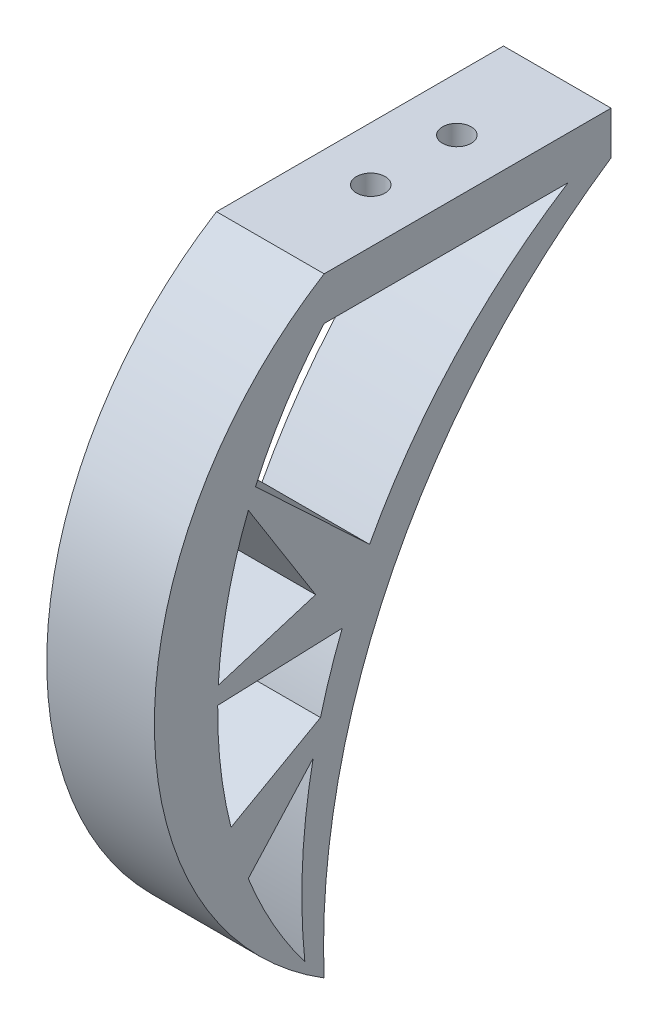
ISO-10303-21;
HEADER;
FILE_DESCRIPTION(('STEP AP214'),'2;1');
FILE_NAME('part.step','',(''),(''),'','','');
FILE_SCHEMA(('AUTOMOTIVE_DESIGN { 1 0 10303 214 1 1 1 1 }'));
ENDSEC;
DATA;
#1=APPLICATION_CONTEXT('core data for automotive mechanical design processes');
#2=APPLICATION_PROTOCOL_DEFINITION('international standard','automotive_design',2000,#1);
#3=PRODUCT_CONTEXT('',#1,'mechanical');
#4=PRODUCT('Part','Part','',(#3));
#5=PRODUCT_RELATED_PRODUCT_CATEGORY('part','',(#4));
#6=PRODUCT_DEFINITION_FORMATION('','',#4);
#7=PRODUCT_DEFINITION_CONTEXT('part definition',#1,'design');
#8=PRODUCT_DEFINITION('design','',#6,#7);
#9=PRODUCT_DEFINITION_SHAPE('','',#8);
#10=(LENGTH_UNIT() NAMED_UNIT(*) SI_UNIT(.MILLI.,.METRE.));
#11=(NAMED_UNIT(*) PLANE_ANGLE_UNIT() SI_UNIT($,.RADIAN.));
#12=(NAMED_UNIT(*) SI_UNIT($,.STERADIAN.) SOLID_ANGLE_UNIT());
#13=UNCERTAINTY_MEASURE_WITH_UNIT(LENGTH_MEASURE(1.E-05),#10,'distance_accuracy_value','');
#14=(GEOMETRIC_REPRESENTATION_CONTEXT(3) GLOBAL_UNCERTAINTY_ASSIGNED_CONTEXT((#13)) GLOBAL_UNIT_ASSIGNED_CONTEXT((#10,
#11,#12)) REPRESENTATION_CONTEXT('',''));
#15=CARTESIAN_POINT('',(0.,0.,0.));
#16=DIRECTION('',(0.,0.,1.));
#17=DIRECTION('',(1.,0.,0.));
#18=AXIS2_PLACEMENT_3D('',#15,#16,#17);
#19=CARTESIAN_POINT('',(15.,-39.5,-45.1635915312323));
#20=DIRECTION('',(-1.,0.,0.));
#21=DIRECTION('',(0.,0.,1.));
#22=AXIS2_PLACEMENT_3D('',#19,#20,#21);
#23=CYLINDRICAL_SURFACE('',#22,60.);
#24=DIRECTION('',(-1.,0.,0.));
#25=VECTOR('',#24,1.);
#26=CARTESIAN_POINT('',(15.,-17.2561392210041,10.5608255374518));
#27=LINE('',#26,#25);
#28=CARTESIAN_POINT('',(15.,-17.2561392210041,10.5608255374517));
#29=VERTEX_POINT('',#28);
#30=CARTESIAN_POINT('',(0.,-17.2561392210041,10.5608255374518));
#31=VERTEX_POINT('',#30);
#32=EDGE_CURVE('E283',#29,#31,#27,.T.);
#33=ORIENTED_EDGE('',*,*,#32,.F.);
#34=CARTESIAN_POINT('',(15.,-39.5,-45.1635915312323));
#35=DIRECTION('',(1.,0.,0.));
#36=DIRECTION('',(0.,0.,1.));
#37=AXIS2_PLACEMENT_3D('',#34,#35,#36);
#38=CIRCLE('',#37,60.);
#39=CARTESIAN_POINT('',(15.,-36.2880127135496,14.7503729317514));
#40=VERTEX_POINT('',#39);
#41=EDGE_CURVE('E221',#29,#40,#38,.T.);
#42=ORIENTED_EDGE('',*,*,#41,.T.);
#43=DIRECTION('',(-1.,0.,0.));
#44=VECTOR('',#43,1.);
#45=CARTESIAN_POINT('',(15.,-36.2880127135496,14.7503729317514));
#46=LINE('',#45,#44);
#47=CARTESIAN_POINT('',(0.,-36.2880127135496,14.7503729317514));
#48=VERTEX_POINT('',#47);
#49=EDGE_CURVE('E171',#48,#40,#46,.F.);
#50=ORIENTED_EDGE('',*,*,#49,.F.);
#51=CARTESIAN_POINT('',(0.,-39.5,-45.1635915312323));
#52=DIRECTION('',(1.,0.,0.));
#53=DIRECTION('',(0.,0.,1.));
#54=AXIS2_PLACEMENT_3D('',#51,#52,#53);
#55=CIRCLE('',#54,60.);
#56=EDGE_CURVE('E58',#31,#48,#55,.T.);
#57=ORIENTED_EDGE('',*,*,#56,.F.);
#58=EDGE_LOOP('',(#33,#42,#50,#57));
#59=FACE_BOUND('',#58,.T.);
#60=ADVANCED_FACE('F35',(#59),#23,.F.);
#61=DIRECTION('',(1.,0.,0.));
#62=VECTOR('',#61,1.);
#63=CARTESIAN_POINT('',(0.,-54.3296215570334,12.9748838914615));
#64=LINE('',#63,#62);
#65=CARTESIAN_POINT('',(0.,-54.3296215570334,12.9748838914615));
#66=VERTEX_POINT('',#65);
#67=CARTESIAN_POINT('',(15.,-54.3296215570334,12.9748838914615));
#68=VERTEX_POINT('',#67);
#69=EDGE_CURVE('E272',#66,#68,#64,.T.);
#70=ORIENTED_EDGE('',*,*,#69,.F.);
#71=CARTESIAN_POINT('',(0.,-38.6765079655165,14.8307570431888));
#72=VERTEX_POINT('',#71);
#73=EDGE_CURVE('E226',#72,#66,#55,.T.);
#74=ORIENTED_EDGE('',*,*,#73,.F.);
#75=DIRECTION('',(-1.,0.,0.));
#76=VECTOR('',#75,1.);
#77=CARTESIAN_POINT('',(15.,-38.6765079655165,14.8307570431888));
#78=LINE('',#77,#76);
#79=CARTESIAN_POINT('',(15.,-38.6765079655165,14.8307570431888));
#80=VERTEX_POINT('',#79);
#81=EDGE_CURVE('E189',#80,#72,#78,.T.);
#82=ORIENTED_EDGE('',*,*,#81,.F.);
#83=EDGE_CURVE('E222',#80,#68,#38,.T.);
#84=ORIENTED_EDGE('',*,*,#83,.T.);
#85=EDGE_LOOP('',(#70,#74,#82,#84));
#86=FACE_BOUND('',#85,.T.);
#87=ADVANCED_FACE('F334',(#86),#23,.F.);
#88=CARTESIAN_POINT('',(15.,-67.5284609681816,-76.894136653729));
#89=DIRECTION('',(-1.,0.,0.));
#90=DIRECTION('',(0.,0.,1.));
#91=AXIS2_PLACEMENT_3D('',#88,#89,#90);
#92=CYLINDRICAL_SURFACE('',#91,80.);
#93=DIRECTION('',(-1.,0.,0.));
#94=VECTOR('',#93,1.);
#95=CARTESIAN_POINT('',(15.,-47.3067647519929,0.507949895279358));
#96=LINE('',#95,#94);
#97=CARTESIAN_POINT('',(15.,-47.3067647519929,0.507949895279351));
#98=VERTEX_POINT('',#97);
#99=CARTESIAN_POINT('',(0.,-47.3067647519929,0.507949895279358));
#100=VERTEX_POINT('',#99);
#101=EDGE_CURVE('E43',#98,#100,#96,.T.);
#102=ORIENTED_EDGE('',*,*,#101,.F.);
#103=CARTESIAN_POINT('',(15.,-67.5284609681816,-76.894136653729));
#104=DIRECTION('',(-1.,0.,0.));
#105=DIRECTION('',(0.,0.,1.));
#106=AXIS2_PLACEMENT_3D('',#103,#104,#105);
#107=CIRCLE('',#106,80.);
#108=CARTESIAN_POINT('',(15.,-38.0360001224991,-2.52885743509172));
#109=VERTEX_POINT('',#108);
#110=EDGE_CURVE('E206',#98,#109,#107,.T.);
#111=ORIENTED_EDGE('',*,*,#110,.T.);
#112=DIRECTION('',(1.,0.,0.));
#113=VECTOR('',#112,1.);
#114=CARTESIAN_POINT('',(0.,-38.0360001224991,-2.52885743509172));
#115=LINE('',#114,#113);
#116=CARTESIAN_POINT('',(0.,-38.0360001224991,-2.52885743509172));
#117=VERTEX_POINT('',#116);
#118=EDGE_CURVE('E172',#117,#109,#115,.T.);
#119=ORIENTED_EDGE('',*,*,#118,.F.);
#120=CARTESIAN_POINT('',(0.,-67.5284609681816,-76.894136653729));
#121=DIRECTION('',(-1.,0.,0.));
#122=DIRECTION('',(0.,0.,1.));
#123=AXIS2_PLACEMENT_3D('',#120,#121,#122);
#124=CIRCLE('',#123,80.);
#125=EDGE_CURVE('E188',#100,#117,#124,.T.);
#126=ORIENTED_EDGE('',*,*,#125,.F.);
#127=EDGE_LOOP('',(#102,#111,#119,#126));
#128=FACE_BOUND('',#127,.T.);
#129=ADVANCED_FACE('F331',(#128),#92,.T.);
#130=DIRECTION('',(-1.,0.,0.));
#131=VECTOR('',#130,1.);
#132=CARTESIAN_POINT('',(15.,-61.71787157674,10.5711927834081));
#133=LINE('',#132,#131);
#134=CARTESIAN_POINT('',(15.,-61.71787157674,10.5711927834081));
#135=VERTEX_POINT('',#134);
#136=CARTESIAN_POINT('',(0.,-61.71787157674,10.5711927834081));
#137=VERTEX_POINT('',#136);
#138=EDGE_CURVE('E275',#135,#137,#133,.T.);
#139=ORIENTED_EDGE('',*,*,#138,.F.);
#140=CARTESIAN_POINT('',(15.,-75.6974368613785,2.68769439366752));
#141=VERTEX_POINT('',#140);
#142=EDGE_CURVE('E218',#135,#141,#38,.T.);
#143=ORIENTED_EDGE('',*,*,#142,.T.);
#144=DIRECTION('',(-1.,0.,0.));
#145=VECTOR('',#144,1.);
#146=CARTESIAN_POINT('',(15.,-75.6974368613785,2.68769439366752));
#147=LINE('',#146,#145);
#148=CARTESIAN_POINT('',(0.,-75.6974368613785,2.68769439366752));
#149=VERTEX_POINT('',#148);
#150=EDGE_CURVE('E212',#141,#149,#147,.T.);
#151=ORIENTED_EDGE('',*,*,#150,.T.);
#152=EDGE_CURVE('E224',#137,#149,#55,.T.);
#153=ORIENTED_EDGE('',*,*,#152,.F.);
#154=EDGE_LOOP('',(#139,#143,#151,#153));
#155=FACE_BOUND('',#154,.T.);
#156=ADVANCED_FACE('F328',(#155),#23,.F.);
#157=DIRECTION('',(1.,0.,0.));
#158=VECTOR('',#157,1.);
#159=CARTESIAN_POINT('',(0.,-29.8247878103833,-6.33612484493494));
#160=LINE('',#159,#158);
#161=CARTESIAN_POINT('',(0.,-29.8247878103833,-6.33612484493494));
#162=VERTEX_POINT('',#161);
#163=CARTESIAN_POINT('',(15.,-29.8247878103833,-6.33612484493494));
#164=VERTEX_POINT('',#163);
#165=EDGE_CURVE('E162',#162,#164,#160,.T.);
#166=ORIENTED_EDGE('',*,*,#165,.T.);
#167=CARTESIAN_POINT('',(15.,0.,-34.));
#168=VERTEX_POINT('',#167);
#169=EDGE_CURVE('E201',#164,#168,#107,.T.);
#170=ORIENTED_EDGE('',*,*,#169,.T.);
#171=DIRECTION('',(-1.,0.,0.));
#172=VECTOR('',#171,1.);
#173=CARTESIAN_POINT('',(15.,0.,-34.));
#174=LINE('',#173,#172);
#175=CARTESIAN_POINT('',(0.,0.,-34.));
#176=VERTEX_POINT('',#175);
#177=EDGE_CURVE('E186',#168,#176,#174,.T.);
#178=ORIENTED_EDGE('',*,*,#177,.T.);
#179=EDGE_CURVE('E177',#162,#176,#124,.T.);
#180=ORIENTED_EDGE('',*,*,#179,.F.);
#181=EDGE_LOOP('',(#166,#170,#178,#180));
#182=FACE_BOUND('',#181,.T.);
#183=ADVANCED_FACE('F184',(#182),#92,.T.);
#184=CARTESIAN_POINT('',(0.,6.,0.));
#185=DIRECTION('',(1.,0.,0.));
#186=DIRECTION('',(0.,0.,-1.));
#187=AXIS2_PLACEMENT_3D('',#184,#185,#186);
#188=PLANE('',#187);
#189=DIRECTION('',(0.,-0.846121438785916,-0.532990160159502));
#190=VECTOR('',#189,1.);
#191=CARTESIAN_POINT('',(0.,-38.0360001224991,-2.52885743509172));
#192=LINE('',#191,#190);
#193=CARTESIAN_POINT('',(0.,-32.1317338202483,1.19036736859185));
#194=VERTEX_POINT('',#193);
#195=EDGE_CURVE('E182',#31,#194,#192,.T.);
#196=ORIENTED_EDGE('',*,*,#195,.F.);
#197=ORIENTED_EDGE('',*,*,#56,.T.);
#198=DIRECTION('',(0.,-0.293053143995621,0.956096153529697));
#199=VECTOR('',#198,1.);
#200=CARTESIAN_POINT('',(0.,-39.,23.5983265064636));
#201=LINE('',#200,#199);
#202=EDGE_CURVE('E291',#194,#48,#201,.T.);
#203=ORIENTED_EDGE('',*,*,#202,.F.);
#204=EDGE_LOOP('',(#196,#197,#203));
#205=FACE_BOUND('',#204,.T.);
#206=ORIENTED_EDGE('',*,*,#125,.T.);
#207=DIRECTION('',(0.,0.0368713436477683,-0.999320020822964));
#208=VECTOR('',#207,1.);
#209=CARTESIAN_POINT('',(0.,-39.,23.5983265064636));
#210=LINE('',#209,#208);
#211=EDGE_CURVE('E288',#72,#117,#210,.T.);
#212=ORIENTED_EDGE('',*,*,#211,.F.);
#213=ORIENTED_EDGE('',*,*,#73,.T.);
#214=DIRECTION('',(0.,-0.490802992807223,0.871270579241302));
#215=VECTOR('',#214,1.);
#216=CARTESIAN_POINT('',(0.,-54.3296215570334,12.9748838914615));
#217=LINE('',#216,#215);
#218=EDGE_CURVE('E263',#100,#66,#217,.T.);
#219=ORIENTED_EDGE('',*,*,#218,.F.);
#220=EDGE_LOOP('',(#206,#212,#213,#219));
#221=FACE_BOUND('',#220,.T.);
#222=CARTESIAN_POINT('',(0.,-36.5,-26.3391343821318));
#223=DIRECTION('',(-1.,0.,0.));
#224=DIRECTION('',(0.,0.,1.));
#225=AXIS2_PLACEMENT_3D('',#222,#223,#224);
#226=CIRCLE('',#225,50.);
#227=CARTESIAN_POINT('',(0.,-79.,0.));
#228=VERTEX_POINT('',#227);
#229=CARTESIAN_POINT('',(0.,6.,0.));
#230=VERTEX_POINT('',#229);
#231=EDGE_CURVE('E211',#228,#230,#226,.T.);
#232=ORIENTED_EDGE('',*,*,#231,.T.);
#233=DIRECTION('',(0.,0.,1.));
#234=VECTOR('',#233,1.);
#235=CARTESIAN_POINT('',(0.,6.,0.));
#236=LINE('',#235,#234);
#237=CARTESIAN_POINT('',(0.,6.,-40.));
#238=VERTEX_POINT('',#237);
#239=EDGE_CURVE('E229',#238,#230,#236,.T.);
#240=ORIENTED_EDGE('',*,*,#239,.F.);
#241=DIRECTION('',(0.,-1.,0.));
#242=VECTOR('',#241,1.);
#243=CARTESIAN_POINT('',(0.,6.,-40.));
#244=LINE('',#243,#242);
#245=CARTESIAN_POINT('',(0.,0.,-40.));
#246=VERTEX_POINT('',#245);
#247=EDGE_CURVE('E240',#238,#246,#244,.T.);
#248=ORIENTED_EDGE('',*,*,#247,.T.);
#249=CARTESIAN_POINT('',(0.,-75.2077576845932,-90.5228214270715));
#250=DIRECTION('',(-1.,0.,0.));
#251=DIRECTION('',(0.,0.,1.));
#252=AXIS2_PLACEMENT_3D('',#249,#250,#251);
#253=CIRCLE('',#252,90.6022201764186);
#254=EDGE_CURVE('E197',#228,#246,#253,.T.);
#255=ORIENTED_EDGE('',*,*,#254,.F.);
#256=EDGE_LOOP('',(#232,#240,#248,#255));
#257=FACE_BOUND('',#256,.T.);
#258=CARTESIAN_POINT('',(0.,0.,0.));
#259=VERTEX_POINT('',#258);
#260=CARTESIAN_POINT('',(0.,-14.9150873128539,9.56831934501429));
#261=VERTEX_POINT('',#260);
#262=EDGE_CURVE('E180',#259,#261,#55,.T.);
#263=ORIENTED_EDGE('',*,*,#262,.T.);
#264=DIRECTION('',(0.,0.68392365017191,0.729553590036764));
#265=VECTOR('',#264,1.);
#266=CARTESIAN_POINT('',(0.,-9.26672138220689,15.5935323077611));
#267=LINE('',#266,#265);
#268=EDGE_CURVE('E165',#162,#261,#267,.T.);
#269=ORIENTED_EDGE('',*,*,#268,.F.);
#270=ORIENTED_EDGE('',*,*,#179,.T.);
#271=DIRECTION('',(0.,0.,1.));
#272=VECTOR('',#271,1.);
#273=CARTESIAN_POINT('',(0.,0.,0.));
#274=LINE('',#273,#272);
#275=EDGE_CURVE('E228',#176,#259,#274,.T.);
#276=ORIENTED_EDGE('',*,*,#275,.T.);
#277=EDGE_LOOP('',(#263,#269,#270,#276));
#278=FACE_BOUND('',#277,.T.);
#279=DIRECTION('',(0.,0.742231143873996,-0.670143961446718));
#280=VECTOR('',#279,1.);
#281=CARTESIAN_POINT('',(0.,-43.926999792177,-5.49178893556122));
#282=LINE('',#281,#280);
#283=CARTESIAN_POINT('',(0.,-51.6972542362221,1.52380066554739));
#284=VERTEX_POINT('',#283);
#285=EDGE_CURVE('E273',#137,#284,#282,.T.);
#286=ORIENTED_EDGE('',*,*,#285,.F.);
#287=ORIENTED_EDGE('',*,*,#152,.T.);
#288=EDGE_CURVE('E191',#149,#284,#124,.T.);
#289=ORIENTED_EDGE('',*,*,#288,.T.);
#290=EDGE_LOOP('',(#286,#287,#289));
#291=FACE_BOUND('',#290,.T.);
#292=ADVANCED_FACE('F37',(#205,#221,#257,#278,#291),#188,.F.);
#293=CARTESIAN_POINT('',(15.,6.,0.));
#294=DIRECTION('',(-1.,0.,0.));
#295=DIRECTION('',(0.,0.,1.));
#296=AXIS2_PLACEMENT_3D('',#293,#294,#295);
#297=PLANE('',#296);
#298=DIRECTION('',(0.,-0.846121438785916,-0.532990160159502));
#299=VECTOR('',#298,1.);
#300=CARTESIAN_POINT('',(15.,-38.0360001224991,-2.52885743509172));
#301=LINE('',#300,#299);
#302=CARTESIAN_POINT('',(15.,-32.1317338202483,1.19036736859185));
#303=VERTEX_POINT('',#302);
#304=EDGE_CURVE('E364',#29,#303,#301,.T.);
#305=ORIENTED_EDGE('',*,*,#304,.T.);
#306=DIRECTION('',(0.,-0.293053143995621,0.956096153529697));
#307=VECTOR('',#306,1.);
#308=CARTESIAN_POINT('',(15.,-39.,23.5983265064636));
#309=LINE('',#308,#307);
#310=EDGE_CURVE('E292',#303,#40,#309,.T.);
#311=ORIENTED_EDGE('',*,*,#310,.T.);
#312=ORIENTED_EDGE('',*,*,#41,.F.);
#313=EDGE_LOOP('',(#305,#311,#312));
#314=FACE_BOUND('',#313,.T.);
#315=DIRECTION('',(0.,0.,-1.));
#316=VECTOR('',#315,1.);
#317=CARTESIAN_POINT('',(15.,6.,0.));
#318=LINE('',#317,#316);
#319=CARTESIAN_POINT('',(15.,6.,0.));
#320=VERTEX_POINT('',#319);
#321=CARTESIAN_POINT('',(15.,6.,-40.));
#322=VERTEX_POINT('',#321);
#323=EDGE_CURVE('E236',#320,#322,#318,.T.);
#324=ORIENTED_EDGE('',*,*,#323,.F.);
#325=CARTESIAN_POINT('',(15.,-36.5,-26.3391343821318));
#326=DIRECTION('',(-1.,0.,0.));
#327=DIRECTION('',(0.,0.,1.));
#328=AXIS2_PLACEMENT_3D('',#325,#326,#327);
#329=CIRCLE('',#328,50.);
#330=CARTESIAN_POINT('',(15.,-79.,0.));
#331=VERTEX_POINT('',#330);
#332=EDGE_CURVE('E216',#331,#320,#329,.T.);
#333=ORIENTED_EDGE('',*,*,#332,.F.);
#334=CARTESIAN_POINT('',(15.,-75.2077576845932,-90.5228214270715));
#335=DIRECTION('',(-1.,0.,0.));
#336=DIRECTION('',(0.,0.,1.));
#337=AXIS2_PLACEMENT_3D('',#334,#335,#336);
#338=CIRCLE('',#337,90.6022201764186);
#339=CARTESIAN_POINT('',(15.,0.,-40.));
#340=VERTEX_POINT('',#339);
#341=EDGE_CURVE('E215',#331,#340,#338,.T.);
#342=ORIENTED_EDGE('',*,*,#341,.T.);
#343=DIRECTION('',(0.,-1.,0.));
#344=VECTOR('',#343,1.);
#345=CARTESIAN_POINT('',(15.,6.,-40.));
#346=LINE('',#345,#344);
#347=EDGE_CURVE('E250',#322,#340,#346,.T.);
#348=ORIENTED_EDGE('',*,*,#347,.F.);
#349=EDGE_LOOP('',(#324,#333,#342,#348));
#350=FACE_BOUND('',#349,.T.);
#351=DIRECTION('',(0.,0.68392365017191,0.729553590036764));
#352=VECTOR('',#351,1.);
#353=CARTESIAN_POINT('',(15.,-9.26672138220689,15.5935323077611));
#354=LINE('',#353,#352);
#355=CARTESIAN_POINT('',(15.,-14.9150873128539,9.56831934501429));
#356=VERTEX_POINT('',#355);
#357=EDGE_CURVE('E167',#164,#356,#354,.T.);
#358=ORIENTED_EDGE('',*,*,#357,.T.);
#359=CARTESIAN_POINT('',(15.,0.,0.));
#360=VERTEX_POINT('',#359);
#361=EDGE_CURVE('E50',#360,#356,#38,.T.);
#362=ORIENTED_EDGE('',*,*,#361,.F.);
#363=DIRECTION('',(0.,0.,-1.));
#364=VECTOR('',#363,1.);
#365=CARTESIAN_POINT('',(15.,0.,0.));
#366=LINE('',#365,#364);
#367=EDGE_CURVE('E244',#360,#168,#366,.T.);
#368=ORIENTED_EDGE('',*,*,#367,.T.);
#369=ORIENTED_EDGE('',*,*,#169,.F.);
#370=EDGE_LOOP('',(#358,#362,#368,#369));
#371=FACE_BOUND('',#370,.T.);
#372=ORIENTED_EDGE('',*,*,#142,.F.);
#373=DIRECTION('',(0.,0.742231143873996,-0.670143961446718));
#374=VECTOR('',#373,1.);
#375=CARTESIAN_POINT('',(15.,-43.926999792177,-5.49178893556122));
#376=LINE('',#375,#374);
#377=CARTESIAN_POINT('',(15.,-51.6972542362221,1.52380066554739));
#378=VERTEX_POINT('',#377);
#379=EDGE_CURVE('E280',#135,#378,#376,.T.);
#380=ORIENTED_EDGE('',*,*,#379,.T.);
#381=EDGE_CURVE('E208',#141,#378,#107,.T.);
#382=ORIENTED_EDGE('',*,*,#381,.F.);
#383=EDGE_LOOP('',(#372,#380,#382));
#384=FACE_BOUND('',#383,.T.);
#385=DIRECTION('',(0.,0.0368713436477683,-0.999320020822964));
#386=VECTOR('',#385,1.);
#387=CARTESIAN_POINT('',(15.,-39.,23.5983265064636));
#388=LINE('',#387,#386);
#389=EDGE_CURVE('E287',#80,#109,#388,.T.);
#390=ORIENTED_EDGE('',*,*,#389,.T.);
#391=ORIENTED_EDGE('',*,*,#110,.F.);
#392=DIRECTION('',(0.,-0.490802992807223,0.871270579241302));
#393=VECTOR('',#392,1.);
#394=CARTESIAN_POINT('',(15.,-54.3296215570334,12.9748838914615));
#395=LINE('',#394,#393);
#396=EDGE_CURVE('E265',#98,#68,#395,.T.);
#397=ORIENTED_EDGE('',*,*,#396,.T.);
#398=ORIENTED_EDGE('',*,*,#83,.F.);
#399=EDGE_LOOP('',(#390,#391,#397,#398));
#400=FACE_BOUND('',#399,.T.);
#401=ADVANCED_FACE('F306',(#314,#350,#371,#384,#400),#297,.F.);
#402=CARTESIAN_POINT('',(0.,6.,-40.));
#403=DIRECTION('',(0.,0.,1.));
#404=DIRECTION('',(1.,0.,0.));
#405=AXIS2_PLACEMENT_3D('',#402,#403,#404);
#406=PLANE('',#405);
#407=DIRECTION('',(-1.,0.,0.));
#408=VECTOR('',#407,1.);
#409=CARTESIAN_POINT('',(0.,0.,-40.));
#410=LINE('',#409,#408);
#411=EDGE_CURVE('E233',#340,#246,#410,.T.);
#412=ORIENTED_EDGE('',*,*,#411,.T.);
#413=ORIENTED_EDGE('',*,*,#247,.F.);
#414=DIRECTION('',(-1.,0.,0.));
#415=VECTOR('',#414,1.);
#416=CARTESIAN_POINT('',(0.,6.,-40.));
#417=LINE('',#416,#415);
#418=EDGE_CURVE('E238',#322,#238,#417,.T.);
#419=ORIENTED_EDGE('',*,*,#418,.F.);
#420=ORIENTED_EDGE('',*,*,#347,.T.);
#421=EDGE_LOOP('',(#412,#413,#419,#420));
#422=FACE_BOUND('',#421,.T.);
#423=ADVANCED_FACE('F313',(#422),#406,.F.);
#424=CARTESIAN_POINT('',(0.,6.,0.));
#425=DIRECTION('',(0.,-1.,0.));
#426=DIRECTION('',(0.,0.,-1.));
#427=AXIS2_PLACEMENT_3D('',#424,#425,#426);
#428=PLANE('',#427);
#429=CARTESIAN_POINT('',(7.50000000000001,6.,-26.));
#430=DIRECTION('',(0.,1.,0.));
#431=DIRECTION('',(0.,0.,1.));
#432=AXIS2_PLACEMENT_3D('',#429,#430,#431);
#433=CIRCLE('',#432,2.);
#434=CARTESIAN_POINT('',(7.50000000000001,6.,-24.));
#435=VERTEX_POINT('',#434);
#436=EDGE_CURVE('E405',#435,#435,#433,.T.);
#437=ORIENTED_EDGE('',*,*,#436,.F.);
#438=EDGE_LOOP('',(#437));
#439=FACE_BOUND('',#438,.T.);
#440=CARTESIAN_POINT('',(7.50000000000001,6.,-14.));
#441=DIRECTION('',(0.,1.,0.));
#442=DIRECTION('',(0.,0.,1.));
#443=AXIS2_PLACEMENT_3D('',#440,#441,#442);
#444=CIRCLE('',#443,2.);
#445=CARTESIAN_POINT('',(7.50000000000001,6.,-12.));
#446=VERTEX_POINT('',#445);
#447=EDGE_CURVE('E409',#446,#446,#444,.T.);
#448=ORIENTED_EDGE('',*,*,#447,.F.);
#449=EDGE_LOOP('',(#448));
#450=FACE_BOUND('',#449,.T.);
#451=ORIENTED_EDGE('',*,*,#239,.T.);
#452=DIRECTION('',(1.,0.,0.));
#453=VECTOR('',#452,1.);
#454=CARTESIAN_POINT('',(0.,6.,0.));
#455=LINE('',#454,#453);
#456=EDGE_CURVE('E232',#230,#320,#455,.T.);
#457=ORIENTED_EDGE('',*,*,#456,.T.);
#458=ORIENTED_EDGE('',*,*,#323,.T.);
#459=ORIENTED_EDGE('',*,*,#418,.T.);
#460=EDGE_LOOP('',(#451,#457,#458,#459));
#461=FACE_BOUND('',#460,.T.);
#462=ADVANCED_FACE('F316',(#439,#450,#461),#428,.F.);
#463=CARTESIAN_POINT('',(0.,0.,0.));
#464=DIRECTION('',(0.,-1.,0.));
#465=DIRECTION('',(0.,0.,-1.));
#466=AXIS2_PLACEMENT_3D('',#463,#464,#465);
#467=PLANE('',#466);
#468=CARTESIAN_POINT('',(7.50000000000001,0.,-26.));
#469=DIRECTION('',(0.,-1.,0.));
#470=DIRECTION('',(0.,0.,-1.));
#471=AXIS2_PLACEMENT_3D('',#468,#469,#470);
#472=CIRCLE('',#471,2.);
#473=CARTESIAN_POINT('',(7.50000000000001,0.,-28.));
#474=VERTEX_POINT('',#473);
#475=EDGE_CURVE('E402',#474,#474,#472,.F.);
#476=ORIENTED_EDGE('',*,*,#475,.T.);
#477=EDGE_LOOP('',(#476));
#478=FACE_BOUND('',#477,.T.);
#479=CARTESIAN_POINT('',(7.50000000000001,0.,-14.));
#480=DIRECTION('',(0.,-1.,0.));
#481=DIRECTION('',(0.,0.,-1.));
#482=AXIS2_PLACEMENT_3D('',#479,#480,#481);
#483=CIRCLE('',#482,2.);
#484=CARTESIAN_POINT('',(7.50000000000001,0.,-16.));
#485=VERTEX_POINT('',#484);
#486=EDGE_CURVE('E412',#485,#485,#483,.F.);
#487=ORIENTED_EDGE('',*,*,#486,.T.);
#488=EDGE_LOOP('',(#487));
#489=FACE_BOUND('',#488,.T.);
#490=ORIENTED_EDGE('',*,*,#177,.F.);
#491=ORIENTED_EDGE('',*,*,#367,.F.);
#492=DIRECTION('',(1.,0.,0.));
#493=VECTOR('',#492,1.);
#494=CARTESIAN_POINT('',(0.,0.,0.));
#495=LINE('',#494,#493);
#496=EDGE_CURVE('E242',#259,#360,#495,.T.);
#497=ORIENTED_EDGE('',*,*,#496,.F.);
#498=ORIENTED_EDGE('',*,*,#275,.F.);
#499=EDGE_LOOP('',(#490,#491,#497,#498));
#500=FACE_BOUND('',#499,.T.);
#501=ADVANCED_FACE('F348',(#478,#489,#500),#467,.T.);
#502=CARTESIAN_POINT('',(15.,-36.5,-26.3391343821318));
#503=DIRECTION('',(-1.,0.,0.));
#504=DIRECTION('',(0.,0.,1.));
#505=AXIS2_PLACEMENT_3D('',#502,#503,#504);
#506=CYLINDRICAL_SURFACE('',#505,50.);
#507=ORIENTED_EDGE('',*,*,#456,.F.);
#508=ORIENTED_EDGE('',*,*,#231,.F.);
#509=DIRECTION('',(-1.,0.,0.));
#510=VECTOR('',#509,1.);
#511=CARTESIAN_POINT('',(15.,-79.,0.));
#512=LINE('',#511,#510);
#513=EDGE_CURVE('E220',#331,#228,#512,.T.);
#514=ORIENTED_EDGE('',*,*,#513,.F.);
#515=ORIENTED_EDGE('',*,*,#332,.T.);
#516=EDGE_LOOP('',(#507,#508,#514,#515));
#517=FACE_BOUND('',#516,.T.);
#518=ADVANCED_FACE('F320',(#517),#506,.T.);
#519=DIRECTION('',(-1.,0.,0.));
#520=VECTOR('',#519,1.);
#521=CARTESIAN_POINT('',(15.,-14.9150873128539,9.56831934501431));
#522=LINE('',#521,#520);
#523=EDGE_CURVE('E181',#261,#356,#522,.F.);
#524=ORIENTED_EDGE('',*,*,#523,.F.);
#525=ORIENTED_EDGE('',*,*,#262,.F.);
#526=ORIENTED_EDGE('',*,*,#496,.T.);
#527=ORIENTED_EDGE('',*,*,#361,.T.);
#528=EDGE_LOOP('',(#524,#525,#526,#527));
#529=FACE_BOUND('',#528,.T.);
#530=ADVANCED_FACE('F336',(#529),#23,.F.);
#531=CARTESIAN_POINT('',(15.,-75.2077576845932,-90.5228214270715));
#532=DIRECTION('',(-1.,0.,0.));
#533=DIRECTION('',(0.,0.,1.));
#534=AXIS2_PLACEMENT_3D('',#531,#532,#533);
#535=CYLINDRICAL_SURFACE('',#534,90.6022201764186);
#536=ORIENTED_EDGE('',*,*,#254,.T.);
#537=ORIENTED_EDGE('',*,*,#411,.F.);
#538=ORIENTED_EDGE('',*,*,#341,.F.);
#539=ORIENTED_EDGE('',*,*,#513,.T.);
#540=EDGE_LOOP('',(#536,#537,#538,#539));
#541=FACE_BOUND('',#540,.T.);
#542=ADVANCED_FACE('F310',(#541),#535,.F.);
#543=DIRECTION('',(-1.,0.,0.));
#544=VECTOR('',#543,1.);
#545=CARTESIAN_POINT('',(15.,-51.6972542362221,1.52380066554737));
#546=LINE('',#545,#544);
#547=EDGE_CURVE('E253',#284,#378,#546,.F.);
#548=ORIENTED_EDGE('',*,*,#547,.F.);
#549=ORIENTED_EDGE('',*,*,#288,.F.);
#550=ORIENTED_EDGE('',*,*,#150,.F.);
#551=ORIENTED_EDGE('',*,*,#381,.T.);
#552=EDGE_LOOP('',(#548,#549,#550,#551));
#553=FACE_BOUND('',#552,.T.);
#554=ADVANCED_FACE('F330',(#553),#92,.T.);
#555=CARTESIAN_POINT('',(0.,-39.,23.5983265064636));
#556=DIRECTION('',(0.,-0.999320020822963,-0.0368713436477682));
#557=DIRECTION('',(0.,0.0368713436477683,-0.999320020822964));
#558=AXIS2_PLACEMENT_3D('',#555,#556,#557);
#559=PLANE('',#558);
#560=ORIENTED_EDGE('',*,*,#389,.F.);
#561=ORIENTED_EDGE('',*,*,#81,.T.);
#562=ORIENTED_EDGE('',*,*,#211,.T.);
#563=ORIENTED_EDGE('',*,*,#118,.T.);
#564=EDGE_LOOP('',(#560,#561,#562,#563));
#565=FACE_BOUND('',#564,.T.);
#566=ADVANCED_FACE('F371',(#565),#559,.T.);
#567=CARTESIAN_POINT('',(0.,-39.,23.5983265064636));
#568=DIRECTION('',(0.,0.956096153529697,0.293053143995621));
#569=DIRECTION('',(0.,-0.293053143995621,0.956096153529697));
#570=AXIS2_PLACEMENT_3D('',#567,#568,#569);
#571=PLANE('',#570);
#572=DIRECTION('',(1.,0.,0.));
#573=VECTOR('',#572,1.);
#574=CARTESIAN_POINT('',(0.,-32.1317338202483,1.19036736859186));
#575=LINE('',#574,#573);
#576=EDGE_CURVE('E11',#194,#303,#575,.T.);
#577=ORIENTED_EDGE('',*,*,#576,.F.);
#578=ORIENTED_EDGE('',*,*,#202,.T.);
#579=ORIENTED_EDGE('',*,*,#49,.T.);
#580=ORIENTED_EDGE('',*,*,#310,.F.);
#581=EDGE_LOOP('',(#577,#578,#579,#580));
#582=FACE_BOUND('',#581,.T.);
#583=ADVANCED_FACE('F367',(#582),#571,.T.);
#584=CARTESIAN_POINT('',(0.,-54.3296215570334,12.9748838914615));
#585=DIRECTION('',(0.,0.871270579241301,0.490802992807223));
#586=DIRECTION('',(0.,-0.490802992807223,0.871270579241302));
#587=AXIS2_PLACEMENT_3D('',#584,#585,#586);
#588=PLANE('',#587);
#589=ORIENTED_EDGE('',*,*,#396,.F.);
#590=ORIENTED_EDGE('',*,*,#101,.T.);
#591=ORIENTED_EDGE('',*,*,#218,.T.);
#592=ORIENTED_EDGE('',*,*,#69,.T.);
#593=EDGE_LOOP('',(#589,#590,#591,#592));
#594=FACE_BOUND('',#593,.T.);
#595=ADVANCED_FACE('F261',(#594),#588,.T.);
#596=CARTESIAN_POINT('',(0.,-43.926999792177,-5.49178893556122));
#597=DIRECTION('',(0.,-0.670143961446718,-0.742231143873996));
#598=DIRECTION('',(0.,0.742231143873996,-0.670143961446718));
#599=AXIS2_PLACEMENT_3D('',#596,#597,#598);
#600=PLANE('',#599);
#601=ORIENTED_EDGE('',*,*,#379,.F.);
#602=ORIENTED_EDGE('',*,*,#138,.T.);
#603=ORIENTED_EDGE('',*,*,#285,.T.);
#604=ORIENTED_EDGE('',*,*,#547,.T.);
#605=EDGE_LOOP('',(#601,#602,#603,#604));
#606=FACE_BOUND('',#605,.T.);
#607=ADVANCED_FACE('F358',(#606),#600,.T.);
#608=CARTESIAN_POINT('',(0.,-38.0360001224991,-2.52885743509172));
#609=DIRECTION('',(0.,-0.532990160159502,0.846121438785916));
#610=DIRECTION('',(0.,-0.846121438785916,-0.532990160159502));
#611=AXIS2_PLACEMENT_3D('',#608,#609,#610);
#612=PLANE('',#611);
#613=ORIENTED_EDGE('',*,*,#304,.F.);
#614=ORIENTED_EDGE('',*,*,#32,.T.);
#615=ORIENTED_EDGE('',*,*,#195,.T.);
#616=ORIENTED_EDGE('',*,*,#576,.T.);
#617=EDGE_LOOP('',(#613,#614,#615,#616));
#618=FACE_BOUND('',#617,.T.);
#619=ADVANCED_FACE('F382',(#618),#612,.T.);
#620=CARTESIAN_POINT('',(0.,-9.26672138220689,15.5935323077611));
#621=DIRECTION('',(0.,0.729553590036764,-0.68392365017191));
#622=DIRECTION('',(0.,0.68392365017191,0.729553590036764));
#623=AXIS2_PLACEMENT_3D('',#620,#621,#622);
#624=PLANE('',#623);
#625=ORIENTED_EDGE('',*,*,#268,.T.);
#626=ORIENTED_EDGE('',*,*,#523,.T.);
#627=ORIENTED_EDGE('',*,*,#357,.F.);
#628=ORIENTED_EDGE('',*,*,#165,.F.);
#629=EDGE_LOOP('',(#625,#626,#627,#628));
#630=FACE_BOUND('',#629,.T.);
#631=ADVANCED_FACE('F164',(#630),#624,.T.);
#632=CARTESIAN_POINT('',(7.50000000000001,-79.001,-14.));
#633=DIRECTION('',(0.,1.,0.));
#634=DIRECTION('',(0.,0.,1.));
#635=AXIS2_PLACEMENT_3D('',#632,#633,#634);
#636=CYLINDRICAL_SURFACE('',#635,2.);
#637=ORIENTED_EDGE('',*,*,#486,.F.);
#638=EDGE_LOOP('',(#637));
#639=FACE_BOUND('',#638,.T.);
#640=ORIENTED_EDGE('',*,*,#447,.T.);
#641=EDGE_LOOP('',(#640));
#642=FACE_BOUND('',#641,.T.);
#643=ADVANCED_FACE('F390',(#639,#642),#636,.F.);
#644=CARTESIAN_POINT('',(7.50000000000001,-79.001,-26.));
#645=DIRECTION('',(0.,1.,0.));
#646=DIRECTION('',(0.,0.,1.));
#647=AXIS2_PLACEMENT_3D('',#644,#645,#646);
#648=CYLINDRICAL_SURFACE('',#647,2.);
#649=ORIENTED_EDGE('',*,*,#475,.F.);
#650=EDGE_LOOP('',(#649));
#651=FACE_BOUND('',#650,.T.);
#652=ORIENTED_EDGE('',*,*,#436,.T.);
#653=EDGE_LOOP('',(#652));
#654=FACE_BOUND('',#653,.T.);
#655=ADVANCED_FACE('F393',(#651,#654),#648,.F.);
#656=CLOSED_SHELL('',(#60,#87,#129,#156,#183,#292,#401,#423,#462,#501,#518,#530,#542,#554,#566,
#583,#595,#607,#619,#631,#643,#655));
#657=MANIFOLD_SOLID_BREP('B2',#656);
#658=ADVANCED_BREP_SHAPE_REPRESENTATION('',(#18,#657),#14);
#659=SHAPE_DEFINITION_REPRESENTATION(#9,#658);
ENDSEC;
END-ISO-10303-21;
